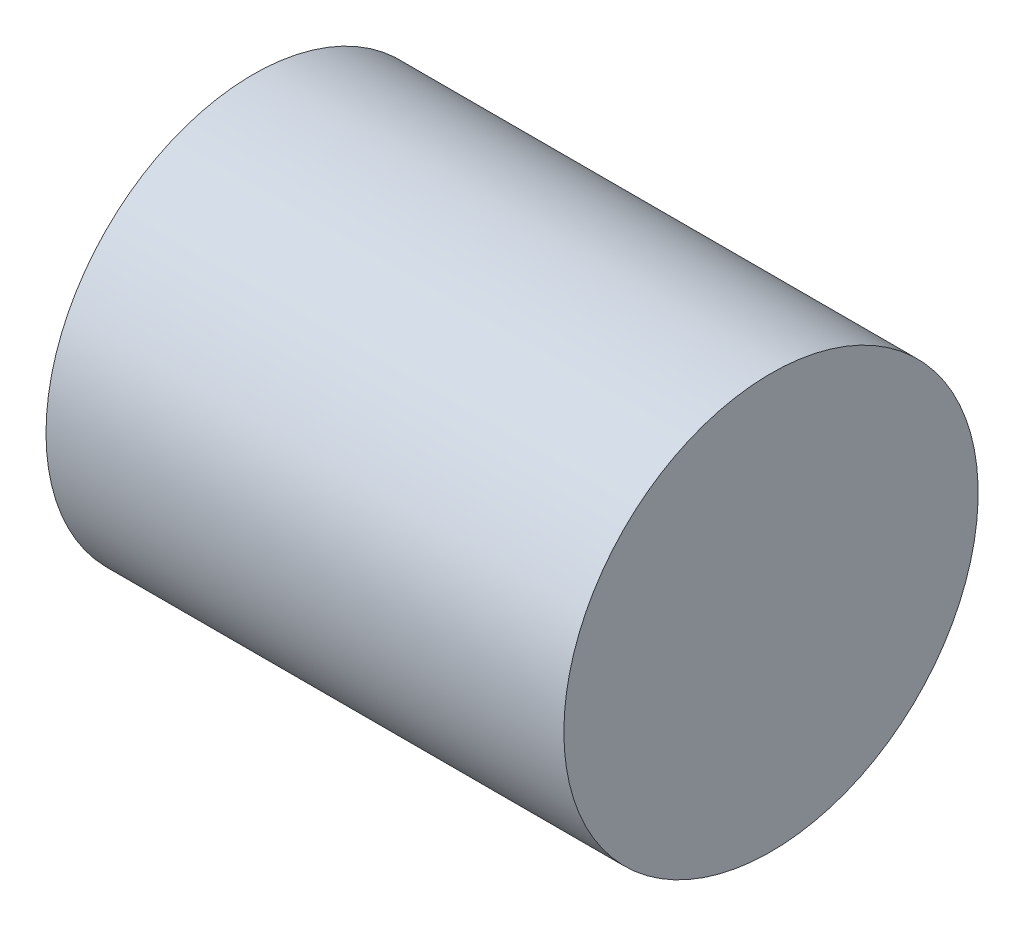
ISO-10303-21;
HEADER;
FILE_DESCRIPTION(('STEP AP214'),'2;1');
FILE_NAME('part.step','',(''),(''),'','','');
FILE_SCHEMA(('AUTOMOTIVE_DESIGN { 1 0 10303 214 1 1 1 1 }'));
ENDSEC;
DATA;
#1=APPLICATION_CONTEXT('core data for automotive mechanical design processes');
#2=APPLICATION_PROTOCOL_DEFINITION('international standard','automotive_design',2000,#1);
#3=PRODUCT_CONTEXT('',#1,'mechanical');
#4=PRODUCT('Part','Part','',(#3));
#5=PRODUCT_RELATED_PRODUCT_CATEGORY('part','',(#4));
#6=PRODUCT_DEFINITION_FORMATION('','',#4);
#7=PRODUCT_DEFINITION_CONTEXT('part definition',#1,'design');
#8=PRODUCT_DEFINITION('design','',#6,#7);
#9=PRODUCT_DEFINITION_SHAPE('','',#8);
#10=(LENGTH_UNIT() NAMED_UNIT(*) SI_UNIT(.MILLI.,.METRE.));
#11=(NAMED_UNIT(*) PLANE_ANGLE_UNIT() SI_UNIT($,.RADIAN.));
#12=(NAMED_UNIT(*) SI_UNIT($,.STERADIAN.) SOLID_ANGLE_UNIT());
#13=UNCERTAINTY_MEASURE_WITH_UNIT(LENGTH_MEASURE(1.E-05),#10,'distance_accuracy_value','');
#14=(GEOMETRIC_REPRESENTATION_CONTEXT(3) GLOBAL_UNCERTAINTY_ASSIGNED_CONTEXT((#13)) GLOBAL_UNIT_ASSIGNED_CONTEXT((#10,
#11,#12)) REPRESENTATION_CONTEXT('',''));
#15=CARTESIAN_POINT('',(0.,0.,0.));
#16=DIRECTION('',(0.,0.,1.));
#17=DIRECTION('',(1.,0.,0.));
#18=AXIS2_PLACEMENT_3D('',#15,#16,#17);
#19=CARTESIAN_POINT('',(0.,0.,0.));
#20=DIRECTION('',(-1.,0.,0.));
#21=DIRECTION('',(0.,0.,1.));
#22=AXIS2_PLACEMENT_3D('',#19,#20,#21);
#23=PLANE('',#22);
#24=CARTESIAN_POINT('',(0.,16.,0.));
#25=DIRECTION('',(-1.,0.,0.));
#26=DIRECTION('',(0.,0.,1.));
#27=AXIS2_PLACEMENT_3D('',#24,#25,#26);
#28=CIRCLE('',#27,16.);
#29=CARTESIAN_POINT('',(0.,16.,16.));
#30=VERTEX_POINT('',#29);
#31=EDGE_CURVE('E46',#30,#30,#28,.T.);
#32=ORIENTED_EDGE('',*,*,#31,.T.);
#33=EDGE_LOOP('',(#32));
#34=FACE_BOUND('',#33,.T.);
#35=ADVANCED_FACE('F39',(#34),#23,.T.);
#36=CARTESIAN_POINT('',(40.,0.,0.));
#37=DIRECTION('',(1.,0.,0.));
#38=DIRECTION('',(0.,0.,-1.));
#39=AXIS2_PLACEMENT_3D('',#36,#37,#38);
#40=PLANE('',#39);
#41=CARTESIAN_POINT('',(40.,16.,0.));
#42=DIRECTION('',(-1.,0.,0.));
#43=DIRECTION('',(0.,0.,1.));
#44=AXIS2_PLACEMENT_3D('',#41,#42,#43);
#45=CIRCLE('',#44,16.);
#46=CARTESIAN_POINT('',(40.,16.,16.));
#47=VERTEX_POINT('',#46);
#48=EDGE_CURVE('E10',#47,#47,#45,.T.);
#49=ORIENTED_EDGE('',*,*,#48,.F.);
#50=EDGE_LOOP('',(#49));
#51=FACE_BOUND('',#50,.T.);
#52=ADVANCED_FACE('F56',(#51),#40,.T.);
#53=CARTESIAN_POINT('',(0.,16.,0.));
#54=DIRECTION('',(-1.,0.,0.));
#55=DIRECTION('',(0.,0.,1.));
#56=AXIS2_PLACEMENT_3D('',#53,#54,#55);
#57=CYLINDRICAL_SURFACE('',#56,16.);
#58=ORIENTED_EDGE('',*,*,#48,.T.);
#59=EDGE_LOOP('',(#58));
#60=FACE_BOUND('',#59,.T.);
#61=ORIENTED_EDGE('',*,*,#31,.F.);
#62=EDGE_LOOP('',(#61));
#63=FACE_BOUND('',#62,.T.);
#64=ADVANCED_FACE('F54',(#60,#63),#57,.T.);
#65=CLOSED_SHELL('',(#35,#52,#64));
#66=MANIFOLD_SOLID_BREP('B2',#65);
#67=ADVANCED_BREP_SHAPE_REPRESENTATION('',(#18,#66),#14);
#68=SHAPE_DEFINITION_REPRESENTATION(#9,#67);
ENDSEC;
END-ISO-10303-21;
